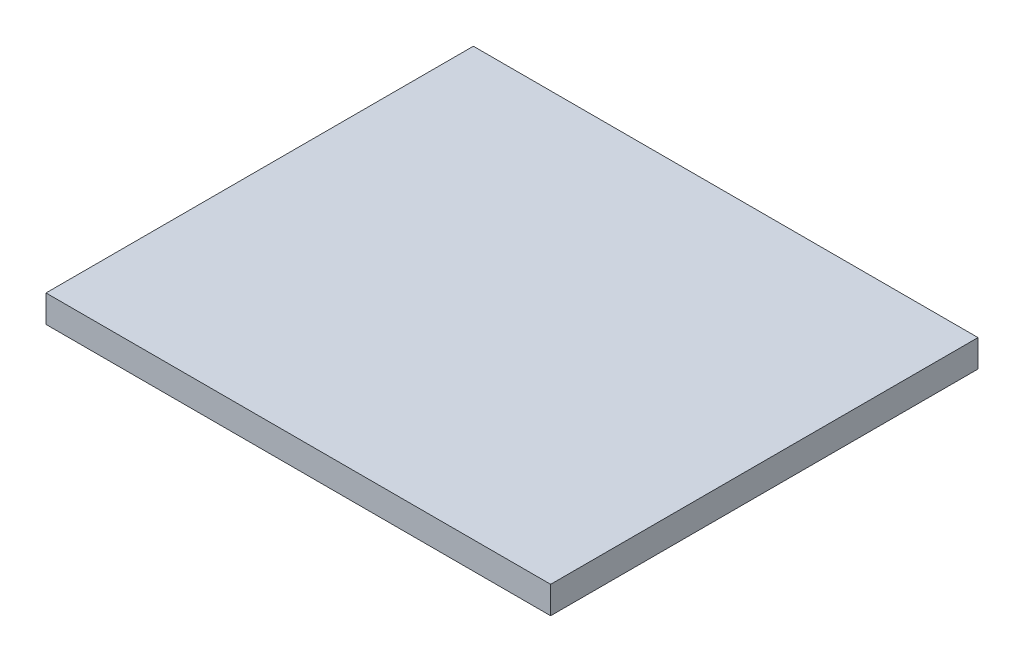
ISO-10303-21;
HEADER;
FILE_DESCRIPTION(('STEP AP214'),'2;1');
FILE_NAME('part.step','',(''),(''),'','','');
FILE_SCHEMA(('AUTOMOTIVE_DESIGN { 1 0 10303 214 1 1 1 1 }'));
ENDSEC;
DATA;
#1=APPLICATION_CONTEXT('core data for automotive mechanical design processes');
#2=APPLICATION_PROTOCOL_DEFINITION('international standard','automotive_design',2000,#1);
#3=PRODUCT_CONTEXT('',#1,'mechanical');
#4=PRODUCT('Part','Part','',(#3));
#5=PRODUCT_RELATED_PRODUCT_CATEGORY('part','',(#4));
#6=PRODUCT_DEFINITION_FORMATION('','',#4);
#7=PRODUCT_DEFINITION_CONTEXT('part definition',#1,'design');
#8=PRODUCT_DEFINITION('design','',#6,#7);
#9=PRODUCT_DEFINITION_SHAPE('','',#8);
#10=(LENGTH_UNIT() NAMED_UNIT(*) SI_UNIT(.MILLI.,.METRE.));
#11=(NAMED_UNIT(*) PLANE_ANGLE_UNIT() SI_UNIT($,.RADIAN.));
#12=(NAMED_UNIT(*) SI_UNIT($,.STERADIAN.) SOLID_ANGLE_UNIT());
#13=UNCERTAINTY_MEASURE_WITH_UNIT(LENGTH_MEASURE(1.E-05),#10,'distance_accuracy_value','');
#14=(GEOMETRIC_REPRESENTATION_CONTEXT(3) GLOBAL_UNCERTAINTY_ASSIGNED_CONTEXT((#13)) GLOBAL_UNIT_ASSIGNED_CONTEXT((#10,
#11,#12)) REPRESENTATION_CONTEXT('',''));
#15=CARTESIAN_POINT('',(0.,0.,0.));
#16=DIRECTION('',(0.,0.,1.));
#17=DIRECTION('',(1.,0.,0.));
#18=AXIS2_PLACEMENT_3D('',#15,#16,#17);
#19=CARTESIAN_POINT('',(0.,6.,0.));
#20=DIRECTION('',(1.,0.,0.));
#21=DIRECTION('',(0.,0.,-1.));
#22=AXIS2_PLACEMENT_3D('',#19,#20,#21);
#23=PLANE('',#22);
#24=DIRECTION('',(0.,0.,1.));
#25=VECTOR('',#24,1.);
#26=CARTESIAN_POINT('',(0.,0.,0.));
#27=LINE('',#26,#25);
#28=CARTESIAN_POINT('',(0.,0.,-94.));
#29=VERTEX_POINT('',#28);
#30=CARTESIAN_POINT('',(0.,0.,0.));
#31=VERTEX_POINT('',#30);
#32=EDGE_CURVE('E100',#29,#31,#27,.T.);
#33=ORIENTED_EDGE('',*,*,#32,.T.);
#34=DIRECTION('',(0.,-1.,0.));
#35=VECTOR('',#34,1.);
#36=CARTESIAN_POINT('',(0.,6.,0.));
#37=LINE('',#36,#35);
#38=CARTESIAN_POINT('',(0.,6.,0.));
#39=VERTEX_POINT('',#38);
#40=EDGE_CURVE('E11',#39,#31,#37,.T.);
#41=ORIENTED_EDGE('',*,*,#40,.F.);
#42=DIRECTION('',(0.,0.,1.));
#43=VECTOR('',#42,1.);
#44=CARTESIAN_POINT('',(0.,6.,0.));
#45=LINE('',#44,#43);
#46=CARTESIAN_POINT('',(0.,6.,-94.));
#47=VERTEX_POINT('',#46);
#48=EDGE_CURVE('E88',#47,#39,#45,.T.);
#49=ORIENTED_EDGE('',*,*,#48,.F.);
#50=DIRECTION('',(0.,-1.,0.));
#51=VECTOR('',#50,1.);
#52=CARTESIAN_POINT('',(0.,6.,-94.));
#53=LINE('',#52,#51);
#54=EDGE_CURVE('E96',#47,#29,#53,.T.);
#55=ORIENTED_EDGE('',*,*,#54,.T.);
#56=EDGE_LOOP('',(#33,#41,#49,#55));
#57=FACE_BOUND('',#56,.T.);
#58=ADVANCED_FACE('F37',(#57),#23,.F.);
#59=CARTESIAN_POINT('',(0.,6.,0.));
#60=DIRECTION('',(0.,0.,-1.));
#61=DIRECTION('',(-1.,0.,0.));
#62=AXIS2_PLACEMENT_3D('',#59,#60,#61);
#63=PLANE('',#62);
#64=DIRECTION('',(1.,0.,0.));
#65=VECTOR('',#64,1.);
#66=CARTESIAN_POINT('',(0.,0.,0.));
#67=LINE('',#66,#65);
#68=CARTESIAN_POINT('',(111.,0.,0.));
#69=VERTEX_POINT('',#68);
#70=EDGE_CURVE('E92',#31,#69,#67,.T.);
#71=ORIENTED_EDGE('',*,*,#70,.T.);
#72=DIRECTION('',(0.,-1.,0.));
#73=VECTOR('',#72,1.);
#74=CARTESIAN_POINT('',(111.,6.,0.));
#75=LINE('',#74,#73);
#76=CARTESIAN_POINT('',(111.,6.,0.));
#77=VERTEX_POINT('',#76);
#78=EDGE_CURVE('E45',#77,#69,#75,.T.);
#79=ORIENTED_EDGE('',*,*,#78,.F.);
#80=DIRECTION('',(1.,0.,0.));
#81=VECTOR('',#80,1.);
#82=CARTESIAN_POINT('',(0.,6.,0.));
#83=LINE('',#82,#81);
#84=EDGE_CURVE('E83',#39,#77,#83,.T.);
#85=ORIENTED_EDGE('',*,*,#84,.F.);
#86=ORIENTED_EDGE('',*,*,#40,.T.);
#87=EDGE_LOOP('',(#71,#79,#85,#86));
#88=FACE_BOUND('',#87,.T.);
#89=ADVANCED_FACE('F91',(#88),#63,.F.);
#90=CARTESIAN_POINT('',(111.,6.,0.));
#91=DIRECTION('',(-1.,0.,0.));
#92=DIRECTION('',(0.,0.,1.));
#93=AXIS2_PLACEMENT_3D('',#90,#91,#92);
#94=PLANE('',#93);
#95=DIRECTION('',(0.,0.,-1.));
#96=VECTOR('',#95,1.);
#97=CARTESIAN_POINT('',(111.,0.,0.));
#98=LINE('',#97,#96);
#99=CARTESIAN_POINT('',(111.,0.,-94.));
#100=VERTEX_POINT('',#99);
#101=EDGE_CURVE('E70',#69,#100,#98,.T.);
#102=ORIENTED_EDGE('',*,*,#101,.T.);
#103=DIRECTION('',(0.,-1.,0.));
#104=VECTOR('',#103,1.);
#105=CARTESIAN_POINT('',(111.,6.,-94.));
#106=LINE('',#105,#104);
#107=CARTESIAN_POINT('',(111.,6.,-94.));
#108=VERTEX_POINT('',#107);
#109=EDGE_CURVE('E93',#108,#100,#106,.T.);
#110=ORIENTED_EDGE('',*,*,#109,.F.);
#111=DIRECTION('',(0.,0.,-1.));
#112=VECTOR('',#111,1.);
#113=CARTESIAN_POINT('',(111.,6.,0.));
#114=LINE('',#113,#112);
#115=EDGE_CURVE('E86',#77,#108,#114,.T.);
#116=ORIENTED_EDGE('',*,*,#115,.F.);
#117=ORIENTED_EDGE('',*,*,#78,.T.);
#118=EDGE_LOOP('',(#102,#110,#116,#117));
#119=FACE_BOUND('',#118,.T.);
#120=ADVANCED_FACE('F94',(#119),#94,.F.);
#121=CARTESIAN_POINT('',(0.,6.,-94.));
#122=DIRECTION('',(0.,0.,1.));
#123=DIRECTION('',(1.,0.,0.));
#124=AXIS2_PLACEMENT_3D('',#121,#122,#123);
#125=PLANE('',#124);
#126=DIRECTION('',(-1.,0.,0.));
#127=VECTOR('',#126,1.);
#128=CARTESIAN_POINT('',(0.,0.,-94.));
#129=LINE('',#128,#127);
#130=EDGE_CURVE('E76',#100,#29,#129,.T.);
#131=ORIENTED_EDGE('',*,*,#130,.T.);
#132=ORIENTED_EDGE('',*,*,#54,.F.);
#133=DIRECTION('',(-1.,0.,0.));
#134=VECTOR('',#133,1.);
#135=CARTESIAN_POINT('',(0.,6.,-94.));
#136=LINE('',#135,#134);
#137=EDGE_CURVE('E53',#108,#47,#136,.T.);
#138=ORIENTED_EDGE('',*,*,#137,.F.);
#139=ORIENTED_EDGE('',*,*,#109,.T.);
#140=EDGE_LOOP('',(#131,#132,#138,#139));
#141=FACE_BOUND('',#140,.T.);
#142=ADVANCED_FACE('F107',(#141),#125,.F.);
#143=CARTESIAN_POINT('',(0.,6.,0.));
#144=DIRECTION('',(0.,-1.,0.));
#145=DIRECTION('',(0.,0.,-1.));
#146=AXIS2_PLACEMENT_3D('',#143,#144,#145);
#147=PLANE('',#146);
#148=ORIENTED_EDGE('',*,*,#48,.T.);
#149=ORIENTED_EDGE('',*,*,#84,.T.);
#150=ORIENTED_EDGE('',*,*,#115,.T.);
#151=ORIENTED_EDGE('',*,*,#137,.T.);
#152=EDGE_LOOP('',(#148,#149,#150,#151));
#153=FACE_BOUND('',#152,.T.);
#154=ADVANCED_FACE('F84',(#153),#147,.F.);
#155=CARTESIAN_POINT('',(0.,0.,0.));
#156=DIRECTION('',(0.,-1.,0.));
#157=DIRECTION('',(0.,0.,-1.));
#158=AXIS2_PLACEMENT_3D('',#155,#156,#157);
#159=PLANE('',#158);
#160=ORIENTED_EDGE('',*,*,#32,.F.);
#161=ORIENTED_EDGE('',*,*,#130,.F.);
#162=ORIENTED_EDGE('',*,*,#101,.F.);
#163=ORIENTED_EDGE('',*,*,#70,.F.);
#164=EDGE_LOOP('',(#160,#161,#162,#163));
#165=FACE_BOUND('',#164,.T.);
#166=ADVANCED_FACE('F110',(#165),#159,.T.);
#167=CLOSED_SHELL('',(#58,#89,#120,#142,#154,#166));
#168=MANIFOLD_SOLID_BREP('B2',#167);
#169=ADVANCED_BREP_SHAPE_REPRESENTATION('',(#18,#168),#14);
#170=SHAPE_DEFINITION_REPRESENTATION(#9,#169);
ENDSEC;
END-ISO-10303-21;
